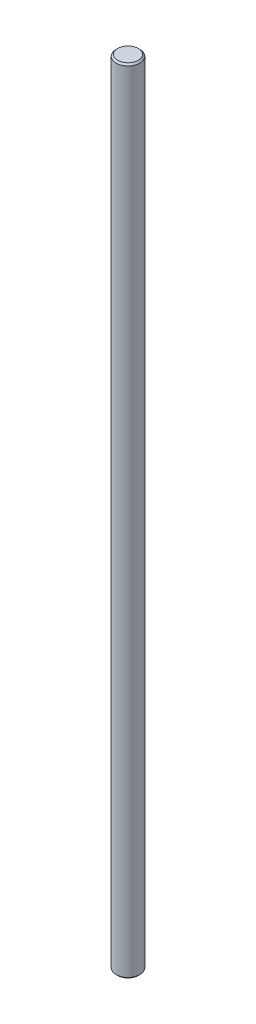
ISO-10303-21;
HEADER;
FILE_DESCRIPTION(('STEP AP214'),'2;1');
FILE_NAME('part.step','',(''),(''),'','','');
FILE_SCHEMA(('AUTOMOTIVE_DESIGN { 1 0 10303 214 1 1 1 1 }'));
ENDSEC;
DATA;
#1=APPLICATION_CONTEXT('core data for automotive mechanical design processes');
#2=APPLICATION_PROTOCOL_DEFINITION('international standard','automotive_design',2000,#1);
#3=PRODUCT_CONTEXT('',#1,'mechanical');
#4=PRODUCT('Part','Part','',(#3));
#5=PRODUCT_RELATED_PRODUCT_CATEGORY('part','',(#4));
#6=PRODUCT_DEFINITION_FORMATION('','',#4);
#7=PRODUCT_DEFINITION_CONTEXT('part definition',#1,'design');
#8=PRODUCT_DEFINITION('design','',#6,#7);
#9=PRODUCT_DEFINITION_SHAPE('','',#8);
#10=(LENGTH_UNIT() NAMED_UNIT(*) SI_UNIT(.MILLI.,.METRE.));
#11=(NAMED_UNIT(*) PLANE_ANGLE_UNIT() SI_UNIT($,.RADIAN.));
#12=(NAMED_UNIT(*) SI_UNIT($,.STERADIAN.) SOLID_ANGLE_UNIT());
#13=UNCERTAINTY_MEASURE_WITH_UNIT(LENGTH_MEASURE(1.E-05),#10,'distance_accuracy_value','');
#14=(GEOMETRIC_REPRESENTATION_CONTEXT(3) GLOBAL_UNCERTAINTY_ASSIGNED_CONTEXT((#13)) GLOBAL_UNIT_ASSIGNED_CONTEXT((#10,
#11,#12)) REPRESENTATION_CONTEXT('',''));
#15=CARTESIAN_POINT('',(0.,0.,0.));
#16=DIRECTION('',(0.,0.,1.));
#17=DIRECTION('',(1.,0.,0.));
#18=AXIS2_PLACEMENT_3D('',#15,#16,#17);
#19=CARTESIAN_POINT('',(0.,100.,0.));
#20=DIRECTION('',(0.,-1.,0.));
#21=DIRECTION('',(0.,0.,-1.));
#22=AXIS2_PLACEMENT_3D('',#19,#20,#21);
#23=CYLINDRICAL_SURFACE('',#22,1.5);
#24=CARTESIAN_POINT('',(0.,0.20000000000002,0.));
#25=DIRECTION('',(0.,1.,0.));
#26=DIRECTION('',(0.,0.,1.));
#27=AXIS2_PLACEMENT_3D('',#24,#25,#26);
#28=CIRCLE('',#27,1.5);
#29=CARTESIAN_POINT('',(0.,0.20000000000002,1.5));
#30=VERTEX_POINT('',#29);
#31=EDGE_CURVE('E48',#30,#30,#28,.T.);
#32=ORIENTED_EDGE('',*,*,#31,.T.);
#33=EDGE_LOOP('',(#32));
#34=FACE_BOUND('',#33,.T.);
#35=CARTESIAN_POINT('',(0.,99.8,0.));
#36=DIRECTION('',(0.,1.,0.));
#37=DIRECTION('',(0.,0.,1.));
#38=AXIS2_PLACEMENT_3D('',#35,#36,#37);
#39=CIRCLE('',#38,1.5);
#40=CARTESIAN_POINT('',(0.,99.8,1.5));
#41=VERTEX_POINT('',#40);
#42=EDGE_CURVE('E53',#41,#41,#39,.F.);
#43=ORIENTED_EDGE('',*,*,#42,.T.);
#44=EDGE_LOOP('',(#43));
#45=FACE_BOUND('',#44,.T.);
#46=ADVANCED_FACE('F35',(#34,#45),#23,.T.);
#47=CARTESIAN_POINT('',(0.,100.,0.));
#48=DIRECTION('',(0.,1.,0.));
#49=DIRECTION('',(0.,0.,1.));
#50=AXIS2_PLACEMENT_3D('',#47,#48,#49);
#51=PLANE('',#50);
#52=CARTESIAN_POINT('',(0.,100.,0.));
#53=DIRECTION('',(0.,1.,0.));
#54=DIRECTION('',(0.,0.,1.));
#55=AXIS2_PLACEMENT_3D('',#52,#53,#54);
#56=CIRCLE('',#55,1.30000000000001);
#57=CARTESIAN_POINT('',(0.,100.,1.30000000000001));
#58=VERTEX_POINT('',#57);
#59=EDGE_CURVE('E10',#58,#58,#56,.T.);
#60=ORIENTED_EDGE('',*,*,#59,.T.);
#61=EDGE_LOOP('',(#60));
#62=FACE_BOUND('',#61,.T.);
#63=ADVANCED_FACE('F70',(#62),#51,.T.);
#64=CARTESIAN_POINT('',(0.,0.,0.));
#65=DIRECTION('',(0.,1.,0.));
#66=DIRECTION('',(0.,0.,1.));
#67=AXIS2_PLACEMENT_3D('',#64,#65,#66);
#68=PLANE('',#67);
#69=CARTESIAN_POINT('',(0.,0.,0.));
#70=DIRECTION('',(0.,1.,0.));
#71=DIRECTION('',(0.,0.,1.));
#72=AXIS2_PLACEMENT_3D('',#69,#70,#71);
#73=CIRCLE('',#72,1.29999999999998);
#74=CARTESIAN_POINT('',(0.,0.,1.29999999999998));
#75=VERTEX_POINT('',#74);
#76=EDGE_CURVE('E43',#75,#75,#73,.F.);
#77=ORIENTED_EDGE('',*,*,#76,.T.);
#78=EDGE_LOOP('',(#77));
#79=FACE_BOUND('',#78,.T.);
#80=ADVANCED_FACE('F67',(#79),#68,.F.);
#81=CARTESIAN_POINT('',(0.,0.20000000000002,0.));
#82=DIRECTION('',(0.,1.,0.));
#83=DIRECTION('',(0.,0.,1.));
#84=AXIS2_PLACEMENT_3D('',#81,#82,#83);
#85=CONICAL_SURFACE('',#84,1.5,0.785398163397445);
#86=ORIENTED_EDGE('',*,*,#76,.F.);
#87=EDGE_LOOP('',(#86));
#88=FACE_BOUND('',#87,.T.);
#89=ORIENTED_EDGE('',*,*,#31,.F.);
#90=EDGE_LOOP('',(#89));
#91=FACE_BOUND('',#90,.T.);
#92=ADVANCED_FACE('F63',(#88,#91),#85,.T.);
#93=CARTESIAN_POINT('',(0.,100.,0.));
#94=DIRECTION('',(0.,-1.,0.));
#95=DIRECTION('',(0.,0.,-1.));
#96=AXIS2_PLACEMENT_3D('',#93,#94,#95);
#97=CONICAL_SURFACE('',#96,1.30000000000001,0.785398163397446);
#98=ORIENTED_EDGE('',*,*,#42,.F.);
#99=EDGE_LOOP('',(#98));
#100=FACE_BOUND('',#99,.T.);
#101=ORIENTED_EDGE('',*,*,#59,.F.);
#102=EDGE_LOOP('',(#101));
#103=FACE_BOUND('',#102,.T.);
#104=ADVANCED_FACE('F37',(#100,#103),#97,.T.);
#105=CLOSED_SHELL('',(#46,#63,#80,#92,#104));
#106=MANIFOLD_SOLID_BREP('B2',#105);
#107=ADVANCED_BREP_SHAPE_REPRESENTATION('',(#18,#106),#14);
#108=SHAPE_DEFINITION_REPRESENTATION(#9,#107);
ENDSEC;
END-ISO-10303-21;
